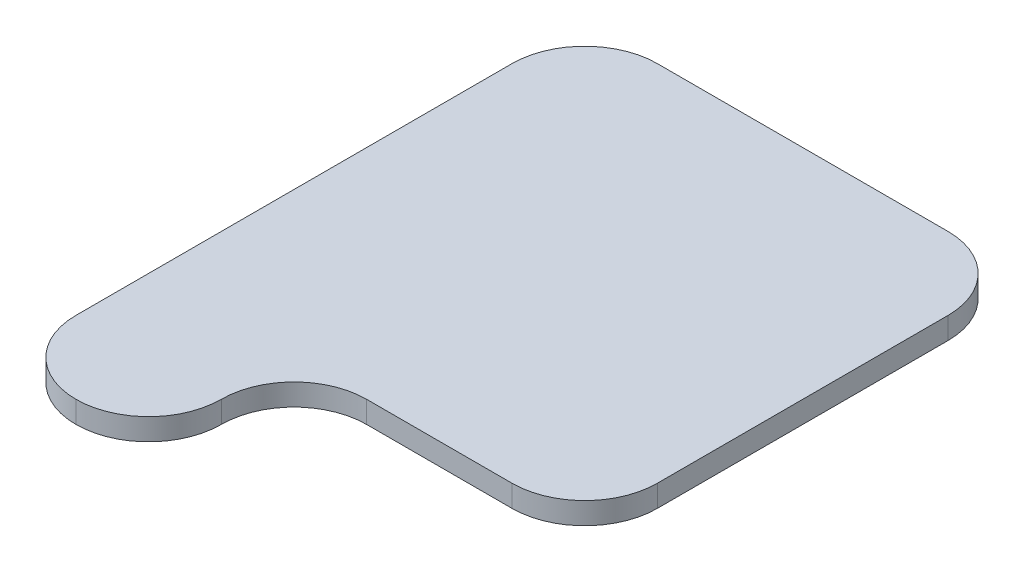
ISO-10303-21;
HEADER;
FILE_DESCRIPTION(('STEP AP214'),'2;1');
FILE_NAME('part.step','',(''),(''),'','','');
FILE_SCHEMA(('AUTOMOTIVE_DESIGN { 1 0 10303 214 1 1 1 1 }'));
ENDSEC;
DATA;
#1=APPLICATION_CONTEXT('core data for automotive mechanical design processes');
#2=APPLICATION_PROTOCOL_DEFINITION('international standard','automotive_design',2000,#1);
#3=PRODUCT_CONTEXT('',#1,'mechanical');
#4=PRODUCT('Part','Part','',(#3));
#5=PRODUCT_RELATED_PRODUCT_CATEGORY('part','',(#4));
#6=PRODUCT_DEFINITION_FORMATION('','',#4);
#7=PRODUCT_DEFINITION_CONTEXT('part definition',#1,'design');
#8=PRODUCT_DEFINITION('design','',#6,#7);
#9=PRODUCT_DEFINITION_SHAPE('','',#8);
#10=(LENGTH_UNIT() NAMED_UNIT(*) SI_UNIT(.MILLI.,.METRE.));
#11=(NAMED_UNIT(*) PLANE_ANGLE_UNIT() SI_UNIT($,.RADIAN.));
#12=(NAMED_UNIT(*) SI_UNIT($,.STERADIAN.) SOLID_ANGLE_UNIT());
#13=UNCERTAINTY_MEASURE_WITH_UNIT(LENGTH_MEASURE(1.E-05),#10,'distance_accuracy_value','');
#14=(GEOMETRIC_REPRESENTATION_CONTEXT(3) GLOBAL_UNCERTAINTY_ASSIGNED_CONTEXT((#13)) GLOBAL_UNIT_ASSIGNED_CONTEXT((#10,
#11,#12)) REPRESENTATION_CONTEXT('',''));
#15=CARTESIAN_POINT('',(0.,0.,0.));
#16=DIRECTION('',(0.,0.,1.));
#17=DIRECTION('',(1.,0.,0.));
#18=AXIS2_PLACEMENT_3D('',#15,#16,#17);
#19=CARTESIAN_POINT('',(0.,15.,0.));
#20=DIRECTION('',(0.,0.,-1.));
#21=DIRECTION('',(-1.,0.,0.));
#22=AXIS2_PLACEMENT_3D('',#19,#20,#21);
#23=PLANE('',#22);
#24=DIRECTION('',(1.,0.,0.));
#25=VECTOR('',#24,1.);
#26=CARTESIAN_POINT('',(0.,0.,0.));
#27=LINE('',#26,#25);
#28=CARTESIAN_POINT('',(150.,0.,0.));
#29=VERTEX_POINT('',#28);
#30=CARTESIAN_POINT('',(250.,0.,0.));
#31=VERTEX_POINT('',#30);
#32=EDGE_CURVE('E204',#29,#31,#27,.T.);
#33=ORIENTED_EDGE('',*,*,#32,.T.);
#34=DIRECTION('',(0.,-1.,0.));
#35=VECTOR('',#34,1.);
#36=CARTESIAN_POINT('',(250.,15.,0.));
#37=LINE('',#36,#35);
#38=CARTESIAN_POINT('',(250.,15.,0.));
#39=VERTEX_POINT('',#38);
#40=EDGE_CURVE('E196',#31,#39,#37,.F.);
#41=ORIENTED_EDGE('',*,*,#40,.T.);
#42=DIRECTION('',(1.,0.,0.));
#43=VECTOR('',#42,1.);
#44=CARTESIAN_POINT('',(0.,15.,0.));
#45=LINE('',#44,#43);
#46=CARTESIAN_POINT('',(150.,15.,0.));
#47=VERTEX_POINT('',#46);
#48=EDGE_CURVE('E142',#47,#39,#45,.T.);
#49=ORIENTED_EDGE('',*,*,#48,.F.);
#50=DIRECTION('',(0.,-1.,0.));
#51=VECTOR('',#50,1.);
#52=CARTESIAN_POINT('',(150.,15.,0.));
#53=LINE('',#52,#51);
#54=EDGE_CURVE('E193',#47,#29,#53,.T.);
#55=ORIENTED_EDGE('',*,*,#54,.T.);
#56=EDGE_LOOP('',(#33,#41,#49,#55));
#57=FACE_BOUND('',#56,.T.);
#58=ADVANCED_FACE('F43',(#57),#23,.F.);
#59=CARTESIAN_POINT('',(300.,15.,-1.11022302462516E-13));
#60=DIRECTION('',(-1.,0.,0.));
#61=DIRECTION('',(0.,0.,1.));
#62=AXIS2_PLACEMENT_3D('',#59,#60,#61);
#63=PLANE('',#62);
#64=DIRECTION('',(0.,0.,-1.));
#65=VECTOR('',#64,1.);
#66=CARTESIAN_POINT('',(300.,0.,-1.11022302462516E-13));
#67=LINE('',#66,#65);
#68=CARTESIAN_POINT('',(300.,0.,-50.));
#69=VERTEX_POINT('',#68);
#70=CARTESIAN_POINT('',(300.,0.,-250.));
#71=VERTEX_POINT('',#70);
#72=EDGE_CURVE('E209',#69,#71,#67,.T.);
#73=ORIENTED_EDGE('',*,*,#72,.T.);
#74=DIRECTION('',(0.,-1.,0.));
#75=VECTOR('',#74,1.);
#76=CARTESIAN_POINT('',(300.,15.,-250.));
#77=LINE('',#76,#75);
#78=CARTESIAN_POINT('',(300.,15.,-250.));
#79=VERTEX_POINT('',#78);
#80=EDGE_CURVE('E190',#71,#79,#77,.F.);
#81=ORIENTED_EDGE('',*,*,#80,.T.);
#82=DIRECTION('',(0.,0.,-1.));
#83=VECTOR('',#82,1.);
#84=CARTESIAN_POINT('',(300.,15.,-1.11022302462516E-13));
#85=LINE('',#84,#83);
#86=CARTESIAN_POINT('',(300.,15.,-50.));
#87=VERTEX_POINT('',#86);
#88=EDGE_CURVE('E235',#87,#79,#85,.T.);
#89=ORIENTED_EDGE('',*,*,#88,.F.);
#90=DIRECTION('',(0.,-1.,0.));
#91=VECTOR('',#90,1.);
#92=CARTESIAN_POINT('',(300.,15.,-50.));
#93=LINE('',#92,#91);
#94=EDGE_CURVE('E186',#87,#69,#93,.T.);
#95=ORIENTED_EDGE('',*,*,#94,.T.);
#96=EDGE_LOOP('',(#73,#81,#89,#95));
#97=FACE_BOUND('',#96,.T.);
#98=ADVANCED_FACE('F248',(#97),#63,.F.);
#99=CARTESIAN_POINT('',(0.,15.,-300.));
#100=DIRECTION('',(0.,0.,-1.));
#101=DIRECTION('',(-1.,0.,0.));
#102=AXIS2_PLACEMENT_3D('',#99,#100,#101);
#103=PLANE('',#102);
#104=DIRECTION('',(1.,0.,0.));
#105=VECTOR('',#104,1.);
#106=CARTESIAN_POINT('',(0.,0.,-300.));
#107=LINE('',#106,#105);
#108=CARTESIAN_POINT('',(50.,0.,-300.));
#109=VERTEX_POINT('',#108);
#110=CARTESIAN_POINT('',(250.,0.,-300.));
#111=VERTEX_POINT('',#110);
#112=EDGE_CURVE('E143',#109,#111,#107,.T.);
#113=ORIENTED_EDGE('',*,*,#112,.F.);
#114=DIRECTION('',(0.,-1.,0.));
#115=VECTOR('',#114,1.);
#116=CARTESIAN_POINT('',(50.,15.,-300.));
#117=LINE('',#116,#115);
#118=CARTESIAN_POINT('',(50.,15.,-300.));
#119=VERTEX_POINT('',#118);
#120=EDGE_CURVE('E170',#109,#119,#117,.F.);
#121=ORIENTED_EDGE('',*,*,#120,.T.);
#122=DIRECTION('',(1.,0.,0.));
#123=VECTOR('',#122,1.);
#124=CARTESIAN_POINT('',(0.,15.,-300.));
#125=LINE('',#124,#123);
#126=CARTESIAN_POINT('',(250.,15.,-300.));
#127=VERTEX_POINT('',#126);
#128=EDGE_CURVE('E152',#119,#127,#125,.T.);
#129=ORIENTED_EDGE('',*,*,#128,.T.);
#130=DIRECTION('',(0.,-1.,0.));
#131=VECTOR('',#130,1.);
#132=CARTESIAN_POINT('',(250.,0.,-300.));
#133=LINE('',#132,#131);
#134=EDGE_CURVE('E166',#127,#111,#133,.T.);
#135=ORIENTED_EDGE('',*,*,#134,.T.);
#136=EDGE_LOOP('',(#113,#121,#129,#135));
#137=FACE_BOUND('',#136,.T.);
#138=ADVANCED_FACE('F224',(#137),#103,.T.);
#139=CARTESIAN_POINT('',(0.,15.,0.));
#140=DIRECTION('',(-1.,0.,0.));
#141=DIRECTION('',(0.,0.,1.));
#142=AXIS2_PLACEMENT_3D('',#139,#140,#141);
#143=PLANE('',#142);
#144=DIRECTION('',(0.,0.,-1.));
#145=VECTOR('',#144,1.);
#146=CARTESIAN_POINT('',(0.,15.,0.));
#147=LINE('',#146,#145);
#148=CARTESIAN_POINT('',(0.,15.,50.));
#149=VERTEX_POINT('',#148);
#150=CARTESIAN_POINT('',(0.,15.,-250.));
#151=VERTEX_POINT('',#150);
#152=EDGE_CURVE('E147',#149,#151,#147,.T.);
#153=ORIENTED_EDGE('',*,*,#152,.T.);
#154=DIRECTION('',(0.,-1.,0.));
#155=VECTOR('',#154,1.);
#156=CARTESIAN_POINT('',(0.,15.,-250.));
#157=LINE('',#156,#155);
#158=CARTESIAN_POINT('',(0.,0.,-250.));
#159=VERTEX_POINT('',#158);
#160=EDGE_CURVE('E140',#151,#159,#157,.T.);
#161=ORIENTED_EDGE('',*,*,#160,.T.);
#162=DIRECTION('',(0.,0.,-1.));
#163=VECTOR('',#162,1.);
#164=CARTESIAN_POINT('',(0.,0.,0.));
#165=LINE('',#164,#163);
#166=CARTESIAN_POINT('',(0.,0.,50.));
#167=VERTEX_POINT('',#166);
#168=EDGE_CURVE('E123',#167,#159,#165,.T.);
#169=ORIENTED_EDGE('',*,*,#168,.F.);
#170=DIRECTION('',(0.,-1.,0.));
#171=VECTOR('',#170,1.);
#172=CARTESIAN_POINT('',(0.,15.,50.));
#173=LINE('',#172,#171);
#174=EDGE_CURVE('E138',#167,#149,#173,.F.);
#175=ORIENTED_EDGE('',*,*,#174,.T.);
#176=EDGE_LOOP('',(#153,#161,#169,#175));
#177=FACE_BOUND('',#176,.T.);
#178=ADVANCED_FACE('F137',(#177),#143,.T.);
#179=CARTESIAN_POINT('',(0.,15.,0.));
#180=DIRECTION('',(0.,1.,0.));
#181=DIRECTION('',(0.,0.,1.));
#182=AXIS2_PLACEMENT_3D('',#179,#180,#181);
#183=PLANE('',#182);
#184=ORIENTED_EDGE('',*,*,#128,.F.);
#185=CARTESIAN_POINT('',(50.,15.,-250.));
#186=DIRECTION('',(0.,1.,0.));
#187=DIRECTION('',(0.,0.,1.));
#188=AXIS2_PLACEMENT_3D('',#185,#186,#187);
#189=CIRCLE('',#188,50.);
#190=EDGE_CURVE('E183',#119,#151,#189,.T.);
#191=ORIENTED_EDGE('',*,*,#190,.T.);
#192=ORIENTED_EDGE('',*,*,#152,.F.);
#193=CARTESIAN_POINT('',(50.,15.,50.));
#194=DIRECTION('',(0.,1.,0.));
#195=DIRECTION('',(0.,0.,1.));
#196=AXIS2_PLACEMENT_3D('',#193,#194,#195);
#197=CIRCLE('',#196,50.);
#198=CARTESIAN_POINT('',(50.,15.,100.));
#199=VERTEX_POINT('',#198);
#200=EDGE_CURVE('E65',#149,#199,#197,.T.);
#201=ORIENTED_EDGE('',*,*,#200,.T.);
#202=CARTESIAN_POINT('',(50.,15.,50.));
#203=DIRECTION('',(0.,1.,0.));
#204=DIRECTION('',(0.,0.,1.));
#205=AXIS2_PLACEMENT_3D('',#202,#203,#204);
#206=CIRCLE('',#205,50.);
#207=CARTESIAN_POINT('',(100.,15.,50.));
#208=VERTEX_POINT('',#207);
#209=EDGE_CURVE('E60',#199,#208,#206,.T.);
#210=ORIENTED_EDGE('',*,*,#209,.T.);
#211=CARTESIAN_POINT('',(150.,15.,50.));
#212=DIRECTION('',(0.,1.,0.));
#213=DIRECTION('',(0.,0.,1.));
#214=AXIS2_PLACEMENT_3D('',#211,#212,#213);
#215=CIRCLE('',#214,50.);
#216=EDGE_CURVE('E11',#208,#47,#215,.F.);
#217=ORIENTED_EDGE('',*,*,#216,.T.);
#218=ORIENTED_EDGE('',*,*,#48,.T.);
#219=CARTESIAN_POINT('',(250.,15.,-50.));
#220=DIRECTION('',(0.,1.,0.));
#221=DIRECTION('',(0.,0.,1.));
#222=AXIS2_PLACEMENT_3D('',#219,#220,#221);
#223=CIRCLE('',#222,50.);
#224=EDGE_CURVE('E177',#39,#87,#223,.T.);
#225=ORIENTED_EDGE('',*,*,#224,.T.);
#226=ORIENTED_EDGE('',*,*,#88,.T.);
#227=CARTESIAN_POINT('',(250.,15.,-250.));
#228=DIRECTION('',(0.,1.,0.));
#229=DIRECTION('',(0.,0.,1.));
#230=AXIS2_PLACEMENT_3D('',#227,#228,#229);
#231=CIRCLE('',#230,50.);
#232=EDGE_CURVE('E180',#79,#127,#231,.T.);
#233=ORIENTED_EDGE('',*,*,#232,.T.);
#234=EDGE_LOOP('',(#184,#191,#192,#201,#210,#217,#218,#225,#226,#233));
#235=FACE_BOUND('',#234,.T.);
#236=ADVANCED_FACE('F231',(#235),#183,.T.);
#237=CARTESIAN_POINT('',(0.,0.,0.));
#238=DIRECTION('',(0.,1.,0.));
#239=DIRECTION('',(0.,0.,1.));
#240=AXIS2_PLACEMENT_3D('',#237,#238,#239);
#241=PLANE('',#240);
#242=ORIENTED_EDGE('',*,*,#168,.T.);
#243=CARTESIAN_POINT('',(50.,0.,-250.));
#244=DIRECTION('',(0.,1.,0.));
#245=DIRECTION('',(0.,0.,1.));
#246=AXIS2_PLACEMENT_3D('',#243,#244,#245);
#247=CIRCLE('',#246,50.);
#248=EDGE_CURVE('E163',#159,#109,#247,.F.);
#249=ORIENTED_EDGE('',*,*,#248,.T.);
#250=ORIENTED_EDGE('',*,*,#112,.T.);
#251=CARTESIAN_POINT('',(250.,0.,-250.));
#252=DIRECTION('',(0.,1.,0.));
#253=DIRECTION('',(0.,0.,1.));
#254=AXIS2_PLACEMENT_3D('',#251,#252,#253);
#255=CIRCLE('',#254,50.);
#256=EDGE_CURVE('E160',#111,#71,#255,.F.);
#257=ORIENTED_EDGE('',*,*,#256,.T.);
#258=ORIENTED_EDGE('',*,*,#72,.F.);
#259=CARTESIAN_POINT('',(250.,0.,-50.));
#260=DIRECTION('',(0.,1.,0.));
#261=DIRECTION('',(0.,0.,1.));
#262=AXIS2_PLACEMENT_3D('',#259,#260,#261);
#263=CIRCLE('',#262,50.);
#264=EDGE_CURVE('E131',#69,#31,#263,.F.);
#265=ORIENTED_EDGE('',*,*,#264,.T.);
#266=ORIENTED_EDGE('',*,*,#32,.F.);
#267=CARTESIAN_POINT('',(150.,0.,50.));
#268=DIRECTION('',(0.,1.,0.));
#269=DIRECTION('',(0.,0.,1.));
#270=AXIS2_PLACEMENT_3D('',#267,#268,#269);
#271=CIRCLE('',#270,50.);
#272=CARTESIAN_POINT('',(100.,0.,50.));
#273=VERTEX_POINT('',#272);
#274=EDGE_CURVE('E53',#29,#273,#271,.T.);
#275=ORIENTED_EDGE('',*,*,#274,.T.);
#276=CARTESIAN_POINT('',(50.,0.,50.));
#277=DIRECTION('',(0.,1.,0.));
#278=DIRECTION('',(0.,0.,1.));
#279=AXIS2_PLACEMENT_3D('',#276,#277,#278);
#280=CIRCLE('',#279,50.);
#281=CARTESIAN_POINT('',(50.,0.,100.));
#282=VERTEX_POINT('',#281);
#283=EDGE_CURVE('E125',#273,#282,#280,.F.);
#284=ORIENTED_EDGE('',*,*,#283,.T.);
#285=CARTESIAN_POINT('',(50.,0.,50.));
#286=DIRECTION('',(0.,1.,0.));
#287=DIRECTION('',(0.,0.,1.));
#288=AXIS2_PLACEMENT_3D('',#285,#286,#287);
#289=CIRCLE('',#288,50.);
#290=EDGE_CURVE('E120',#282,#167,#289,.F.);
#291=ORIENTED_EDGE('',*,*,#290,.T.);
#292=EDGE_LOOP('',(#242,#249,#250,#257,#258,#265,#266,#275,#284,#291));
#293=FACE_BOUND('',#292,.T.);
#294=ADVANCED_FACE('F122',(#293),#241,.F.);
#295=CARTESIAN_POINT('',(50.,15.,-250.));
#296=DIRECTION('',(0.,-1.,0.));
#297=DIRECTION('',(0.,0.,-1.));
#298=AXIS2_PLACEMENT_3D('',#295,#296,#297);
#299=CYLINDRICAL_SURFACE('',#298,50.);
#300=ORIENTED_EDGE('',*,*,#190,.F.);
#301=ORIENTED_EDGE('',*,*,#120,.F.);
#302=ORIENTED_EDGE('',*,*,#248,.F.);
#303=ORIENTED_EDGE('',*,*,#160,.F.);
#304=EDGE_LOOP('',(#300,#301,#302,#303));
#305=FACE_BOUND('',#304,.T.);
#306=ADVANCED_FACE('F230',(#305),#299,.T.);
#307=CARTESIAN_POINT('',(150.,15.,50.));
#308=DIRECTION('',(0.,-1.,0.));
#309=DIRECTION('',(0.,0.,-1.));
#310=AXIS2_PLACEMENT_3D('',#307,#308,#309);
#311=CYLINDRICAL_SURFACE('',#310,50.);
#312=ORIENTED_EDGE('',*,*,#54,.F.);
#313=ORIENTED_EDGE('',*,*,#216,.F.);
#314=DIRECTION('',(0.,-1.,0.));
#315=VECTOR('',#314,1.);
#316=CARTESIAN_POINT('',(100.,15.,50.));
#317=LINE('',#316,#315);
#318=EDGE_CURVE('E47',#273,#208,#317,.F.);
#319=ORIENTED_EDGE('',*,*,#318,.F.);
#320=ORIENTED_EDGE('',*,*,#274,.F.);
#321=EDGE_LOOP('',(#312,#313,#319,#320));
#322=FACE_BOUND('',#321,.T.);
#323=ADVANCED_FACE('F252',(#322),#311,.F.);
#324=CARTESIAN_POINT('',(50.,15.,50.));
#325=DIRECTION('',(0.,1.,0.));
#326=DIRECTION('',(0.,0.,1.));
#327=AXIS2_PLACEMENT_3D('',#324,#325,#326);
#328=CYLINDRICAL_SURFACE('',#327,50.);
#329=ORIENTED_EDGE('',*,*,#318,.T.);
#330=ORIENTED_EDGE('',*,*,#209,.F.);
#331=DIRECTION('',(0.,-1.,0.));
#332=VECTOR('',#331,1.);
#333=CARTESIAN_POINT('',(50.,15.,100.));
#334=LINE('',#333,#332);
#335=EDGE_CURVE('E200',#282,#199,#334,.F.);
#336=ORIENTED_EDGE('',*,*,#335,.F.);
#337=ORIENTED_EDGE('',*,*,#283,.F.);
#338=EDGE_LOOP('',(#329,#330,#336,#337));
#339=FACE_BOUND('',#338,.T.);
#340=ADVANCED_FACE('F253',(#339),#328,.T.);
#341=CARTESIAN_POINT('',(50.,15.,50.));
#342=DIRECTION('',(0.,1.,0.));
#343=DIRECTION('',(0.,0.,1.));
#344=AXIS2_PLACEMENT_3D('',#341,#342,#343);
#345=CYLINDRICAL_SURFACE('',#344,50.);
#346=ORIENTED_EDGE('',*,*,#200,.F.);
#347=ORIENTED_EDGE('',*,*,#174,.F.);
#348=ORIENTED_EDGE('',*,*,#290,.F.);
#349=ORIENTED_EDGE('',*,*,#335,.T.);
#350=EDGE_LOOP('',(#346,#347,#348,#349));
#351=FACE_BOUND('',#350,.T.);
#352=ADVANCED_FACE('F145',(#351),#345,.T.);
#353=CARTESIAN_POINT('',(250.,15.,-250.));
#354=DIRECTION('',(0.,1.,0.));
#355=DIRECTION('',(0.,0.,1.));
#356=AXIS2_PLACEMENT_3D('',#353,#354,#355);
#357=CYLINDRICAL_SURFACE('',#356,50.);
#358=ORIENTED_EDGE('',*,*,#232,.F.);
#359=ORIENTED_EDGE('',*,*,#80,.F.);
#360=ORIENTED_EDGE('',*,*,#256,.F.);
#361=ORIENTED_EDGE('',*,*,#134,.F.);
#362=EDGE_LOOP('',(#358,#359,#360,#361));
#363=FACE_BOUND('',#362,.T.);
#364=ADVANCED_FACE('F260',(#363),#357,.T.);
#365=CARTESIAN_POINT('',(250.,15.,-50.));
#366=DIRECTION('',(0.,-1.,0.));
#367=DIRECTION('',(0.,0.,-1.));
#368=AXIS2_PLACEMENT_3D('',#365,#366,#367);
#369=CYLINDRICAL_SURFACE('',#368,50.);
#370=ORIENTED_EDGE('',*,*,#224,.F.);
#371=ORIENTED_EDGE('',*,*,#40,.F.);
#372=ORIENTED_EDGE('',*,*,#264,.F.);
#373=ORIENTED_EDGE('',*,*,#94,.F.);
#374=EDGE_LOOP('',(#370,#371,#372,#373));
#375=FACE_BOUND('',#374,.T.);
#376=ADVANCED_FACE('F45',(#375),#369,.T.);
#377=CLOSED_SHELL('',(#58,#98,#138,#178,#236,#294,#306,#323,#340,#352,#364,#376));
#378=MANIFOLD_SOLID_BREP('B2',#377);
#379=ADVANCED_BREP_SHAPE_REPRESENTATION('',(#18,#378),#14);
#380=SHAPE_DEFINITION_REPRESENTATION(#9,#379);
ENDSEC;
END-ISO-10303-21;
